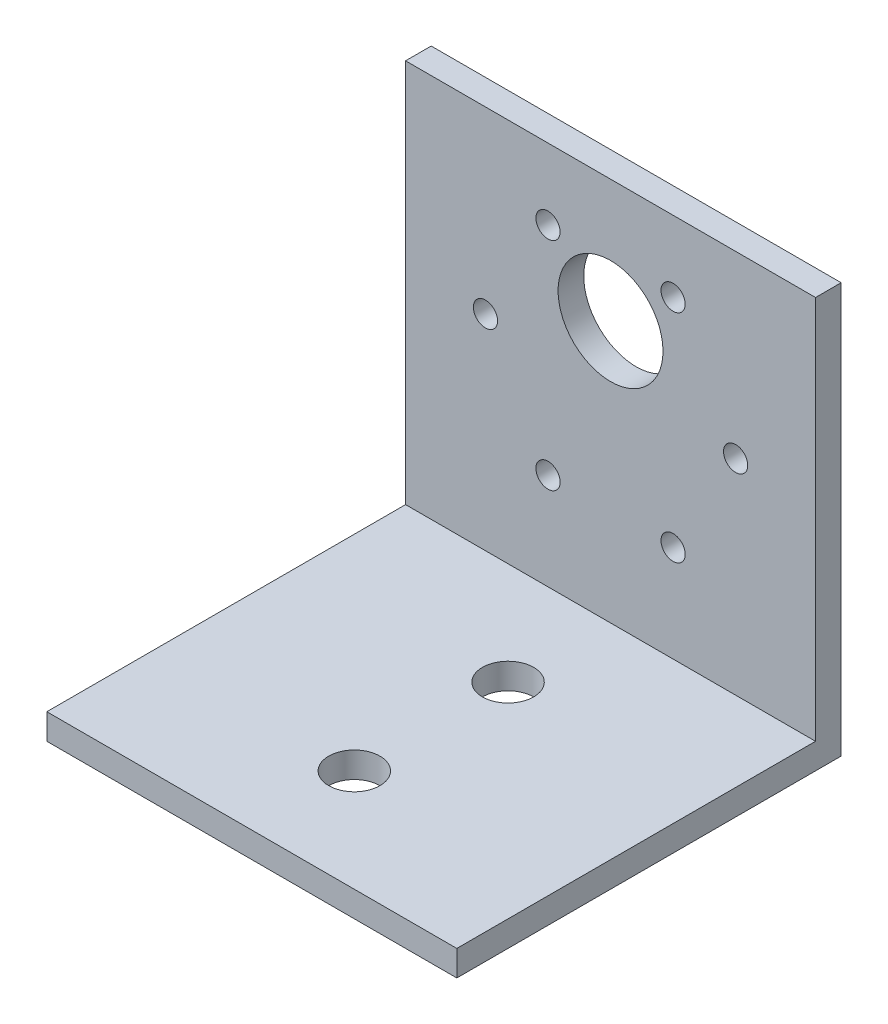
ISO-10303-21;
HEADER;
FILE_DESCRIPTION(('STEP AP214'),'2;1');
FILE_NAME('part.step','',(''),(''),'','','');
FILE_SCHEMA(('AUTOMOTIVE_DESIGN { 1 0 10303 214 1 1 1 1 }'));
ENDSEC;
DATA;
#1=APPLICATION_CONTEXT('core data for automotive mechanical design processes');
#2=APPLICATION_PROTOCOL_DEFINITION('international standard','automotive_design',2000,#1);
#3=PRODUCT_CONTEXT('',#1,'mechanical');
#4=PRODUCT('Part','Part','',(#3));
#5=PRODUCT_RELATED_PRODUCT_CATEGORY('part','',(#4));
#6=PRODUCT_DEFINITION_FORMATION('','',#4);
#7=PRODUCT_DEFINITION_CONTEXT('part definition',#1,'design');
#8=PRODUCT_DEFINITION('design','',#6,#7);
#9=PRODUCT_DEFINITION_SHAPE('','',#8);
#10=(LENGTH_UNIT() NAMED_UNIT(*) SI_UNIT(.MILLI.,.METRE.));
#11=(NAMED_UNIT(*) PLANE_ANGLE_UNIT() SI_UNIT($,.RADIAN.));
#12=(NAMED_UNIT(*) SI_UNIT($,.STERADIAN.) SOLID_ANGLE_UNIT());
#13=UNCERTAINTY_MEASURE_WITH_UNIT(LENGTH_MEASURE(1.E-05),#10,'distance_accuracy_value','');
#14=(GEOMETRIC_REPRESENTATION_CONTEXT(3) GLOBAL_UNCERTAINTY_ASSIGNED_CONTEXT((#13)) GLOBAL_UNIT_ASSIGNED_CONTEXT((#10,
#11,#12)) REPRESENTATION_CONTEXT('',''));
#15=CARTESIAN_POINT('',(0.,0.,0.));
#16=DIRECTION('',(0.,0.,1.));
#17=DIRECTION('',(1.,0.,0.));
#18=AXIS2_PLACEMENT_3D('',#15,#16,#17);
#19=CARTESIAN_POINT('',(0.,0.,3.175));
#20=DIRECTION('',(0.,0.,-1.));
#21=DIRECTION('',(-1.,0.,0.));
#22=AXIS2_PLACEMENT_3D('',#19,#20,#21);
#23=PLANE('',#22);
#24=CARTESIAN_POINT('',(33.15,41.9983937586588,3.175));
#25=DIRECTION('',(0.,0.,1.));
#26=DIRECTION('',(1.,0.,0.));
#27=AXIS2_PLACEMENT_3D('',#24,#25,#26);
#28=CIRCLE('',#27,1.50000000000002);
#29=CARTESIAN_POINT('',(34.65,41.9983937586588,3.175));
#30=VERTEX_POINT('',#29);
#31=EDGE_CURVE('E147',#30,#30,#28,.T.);
#32=ORIENTED_EDGE('',*,*,#31,.F.);
#33=EDGE_LOOP('',(#32));
#34=FACE_BOUND('',#33,.T.);
#35=CARTESIAN_POINT('',(17.65,15.1516062413412,3.175));
#36=DIRECTION('',(0.,0.,1.));
#37=DIRECTION('',(1.,0.,0.));
#38=AXIS2_PLACEMENT_3D('',#35,#36,#37);
#39=CIRCLE('',#38,1.50000000000001);
#40=CARTESIAN_POINT('',(19.15,15.1516062413412,3.175));
#41=VERTEX_POINT('',#40);
#42=EDGE_CURVE('E135',#41,#41,#39,.T.);
#43=ORIENTED_EDGE('',*,*,#42,.F.);
#44=EDGE_LOOP('',(#43));
#45=FACE_BOUND('',#44,.T.);
#46=CARTESIAN_POINT('',(40.9,28.575,3.175));
#47=DIRECTION('',(0.,0.,1.));
#48=DIRECTION('',(1.,0.,0.));
#49=AXIS2_PLACEMENT_3D('',#46,#47,#48);
#50=CIRCLE('',#49,1.5);
#51=CARTESIAN_POINT('',(42.4,28.575,3.175));
#52=VERTEX_POINT('',#51);
#53=EDGE_CURVE('E123',#52,#52,#50,.T.);
#54=ORIENTED_EDGE('',*,*,#53,.F.);
#55=EDGE_LOOP('',(#54));
#56=FACE_BOUND('',#55,.T.);
#57=CARTESIAN_POINT('',(25.4,35.575,3.175));
#58=DIRECTION('',(0.,0.,1.));
#59=DIRECTION('',(1.,0.,0.));
#60=AXIS2_PLACEMENT_3D('',#57,#58,#59);
#61=CIRCLE('',#60,6.50000000000002);
#62=CARTESIAN_POINT('',(31.9,35.575,3.175));
#63=VERTEX_POINT('',#62);
#64=EDGE_CURVE('E97',#63,#63,#61,.T.);
#65=ORIENTED_EDGE('',*,*,#64,.F.);
#66=EDGE_LOOP('',(#65));
#67=FACE_BOUND('',#66,.T.);
#68=CARTESIAN_POINT('',(9.90000000000003,28.575,3.175));
#69=DIRECTION('',(0.,0.,1.));
#70=DIRECTION('',(1.,0.,0.));
#71=AXIS2_PLACEMENT_3D('',#68,#69,#70);
#72=CIRCLE('',#71,1.5);
#73=CARTESIAN_POINT('',(11.4,28.575,3.175));
#74=VERTEX_POINT('',#73);
#75=EDGE_CURVE('E118',#74,#74,#72,.T.);
#76=ORIENTED_EDGE('',*,*,#75,.F.);
#77=EDGE_LOOP('',(#76));
#78=FACE_BOUND('',#77,.T.);
#79=CARTESIAN_POINT('',(33.15,15.1516062413412,3.175));
#80=DIRECTION('',(0.,0.,1.));
#81=DIRECTION('',(1.,0.,0.));
#82=AXIS2_PLACEMENT_3D('',#79,#80,#81);
#83=CIRCLE('',#82,1.5);
#84=CARTESIAN_POINT('',(34.65,15.1516062413412,3.175));
#85=VERTEX_POINT('',#84);
#86=EDGE_CURVE('E129',#85,#85,#83,.T.);
#87=ORIENTED_EDGE('',*,*,#86,.F.);
#88=EDGE_LOOP('',(#87));
#89=FACE_BOUND('',#88,.T.);
#90=CARTESIAN_POINT('',(17.65,41.9983937586588,3.175));
#91=DIRECTION('',(0.,0.,1.));
#92=DIRECTION('',(1.,0.,0.));
#93=AXIS2_PLACEMENT_3D('',#90,#91,#92);
#94=CIRCLE('',#93,1.50000000000001);
#95=CARTESIAN_POINT('',(19.15,41.9983937586588,3.175));
#96=VERTEX_POINT('',#95);
#97=EDGE_CURVE('E141',#96,#96,#94,.T.);
#98=ORIENTED_EDGE('',*,*,#97,.F.);
#99=EDGE_LOOP('',(#98));
#100=FACE_BOUND('',#99,.T.);
#101=DIRECTION('',(-1.,0.,0.));
#102=VECTOR('',#101,1.);
#103=CARTESIAN_POINT('',(0.,3.175,3.175));
#104=LINE('',#103,#102);
#105=CARTESIAN_POINT('',(50.8,3.175,3.175));
#106=VERTEX_POINT('',#105);
#107=CARTESIAN_POINT('',(0.,3.175,3.175));
#108=VERTEX_POINT('',#107);
#109=EDGE_CURVE('E50',#106,#108,#104,.T.);
#110=ORIENTED_EDGE('',*,*,#109,.F.);
#111=DIRECTION('',(0.,1.,0.));
#112=VECTOR('',#111,1.);
#113=CARTESIAN_POINT('',(50.8,0.,3.175));
#114=LINE('',#113,#112);
#115=CARTESIAN_POINT('',(50.8,50.8,3.175));
#116=VERTEX_POINT('',#115);
#117=EDGE_CURVE('E112',#106,#116,#114,.T.);
#118=ORIENTED_EDGE('',*,*,#117,.T.);
#119=DIRECTION('',(-1.,0.,0.));
#120=VECTOR('',#119,1.);
#121=CARTESIAN_POINT('',(0.,50.8,3.175));
#122=LINE('',#121,#120);
#123=CARTESIAN_POINT('',(0.,50.8,3.175));
#124=VERTEX_POINT('',#123);
#125=EDGE_CURVE('E56',#116,#124,#122,.T.);
#126=ORIENTED_EDGE('',*,*,#125,.T.);
#127=DIRECTION('',(0.,-1.,0.));
#128=VECTOR('',#127,1.);
#129=CARTESIAN_POINT('',(0.,0.,3.175));
#130=LINE('',#129,#128);
#131=EDGE_CURVE('E85',#124,#108,#130,.T.);
#132=ORIENTED_EDGE('',*,*,#131,.T.);
#133=EDGE_LOOP('',(#110,#118,#126,#132));
#134=FACE_BOUND('',#133,.T.);
#135=ADVANCED_FACE('F33',(#34,#45,#56,#67,#78,#89,#100,#134),#23,.F.);
#136=CARTESIAN_POINT('',(0.,0.,0.));
#137=DIRECTION('',(0.,0.,-1.));
#138=DIRECTION('',(-1.,0.,0.));
#139=AXIS2_PLACEMENT_3D('',#136,#137,#138);
#140=PLANE('',#139);
#141=CARTESIAN_POINT('',(17.65,41.9983937586588,0.));
#142=DIRECTION('',(0.,0.,1.));
#143=DIRECTION('',(1.,0.,0.));
#144=AXIS2_PLACEMENT_3D('',#141,#142,#143);
#145=CIRCLE('',#144,1.50000000000001);
#146=CARTESIAN_POINT('',(19.15,41.9983937586588,0.));
#147=VERTEX_POINT('',#146);
#148=EDGE_CURVE('E144',#147,#147,#145,.T.);
#149=ORIENTED_EDGE('',*,*,#148,.T.);
#150=EDGE_LOOP('',(#149));
#151=FACE_BOUND('',#150,.T.);
#152=CARTESIAN_POINT('',(33.15,15.1516062413412,0.));
#153=DIRECTION('',(0.,0.,1.));
#154=DIRECTION('',(1.,0.,0.));
#155=AXIS2_PLACEMENT_3D('',#152,#153,#154);
#156=CIRCLE('',#155,1.5);
#157=CARTESIAN_POINT('',(34.65,15.1516062413412,0.));
#158=VERTEX_POINT('',#157);
#159=EDGE_CURVE('E132',#158,#158,#156,.T.);
#160=ORIENTED_EDGE('',*,*,#159,.T.);
#161=EDGE_LOOP('',(#160));
#162=FACE_BOUND('',#161,.T.);
#163=CARTESIAN_POINT('',(9.90000000000003,28.575,0.));
#164=DIRECTION('',(0.,0.,1.));
#165=DIRECTION('',(1.,0.,0.));
#166=AXIS2_PLACEMENT_3D('',#163,#164,#165);
#167=CIRCLE('',#166,1.5);
#168=CARTESIAN_POINT('',(11.4,28.575,0.));
#169=VERTEX_POINT('',#168);
#170=EDGE_CURVE('E120',#169,#169,#167,.T.);
#171=ORIENTED_EDGE('',*,*,#170,.T.);
#172=EDGE_LOOP('',(#171));
#173=FACE_BOUND('',#172,.T.);
#174=DIRECTION('',(0.,-1.,0.));
#175=VECTOR('',#174,1.);
#176=CARTESIAN_POINT('',(0.,0.,0.));
#177=LINE('',#176,#175);
#178=CARTESIAN_POINT('',(0.,50.8,0.));
#179=VERTEX_POINT('',#178);
#180=CARTESIAN_POINT('',(0.,0.,0.));
#181=VERTEX_POINT('',#180);
#182=EDGE_CURVE('E91',#179,#181,#177,.T.);
#183=ORIENTED_EDGE('',*,*,#182,.F.);
#184=DIRECTION('',(-1.,0.,0.));
#185=VECTOR('',#184,1.);
#186=CARTESIAN_POINT('',(0.,50.8,0.));
#187=LINE('',#186,#185);
#188=CARTESIAN_POINT('',(50.8,50.8,0.));
#189=VERTEX_POINT('',#188);
#190=EDGE_CURVE('E75',#189,#179,#187,.T.);
#191=ORIENTED_EDGE('',*,*,#190,.F.);
#192=DIRECTION('',(0.,1.,0.));
#193=VECTOR('',#192,1.);
#194=CARTESIAN_POINT('',(50.8,0.,0.));
#195=LINE('',#194,#193);
#196=CARTESIAN_POINT('',(50.8,0.,0.));
#197=VERTEX_POINT('',#196);
#198=EDGE_CURVE('E86',#197,#189,#195,.T.);
#199=ORIENTED_EDGE('',*,*,#198,.F.);
#200=DIRECTION('',(1.,0.,0.));
#201=VECTOR('',#200,1.);
#202=CARTESIAN_POINT('',(0.,0.,0.));
#203=LINE('',#202,#201);
#204=EDGE_CURVE('E96',#181,#197,#203,.T.);
#205=ORIENTED_EDGE('',*,*,#204,.F.);
#206=EDGE_LOOP('',(#183,#191,#199,#205));
#207=FACE_BOUND('',#206,.T.);
#208=CARTESIAN_POINT('',(25.4,35.575,0.));
#209=DIRECTION('',(0.,0.,1.));
#210=DIRECTION('',(1.,0.,0.));
#211=AXIS2_PLACEMENT_3D('',#208,#209,#210);
#212=CIRCLE('',#211,6.50000000000002);
#213=CARTESIAN_POINT('',(31.9,35.575,0.));
#214=VERTEX_POINT('',#213);
#215=EDGE_CURVE('E101',#214,#214,#212,.T.);
#216=ORIENTED_EDGE('',*,*,#215,.T.);
#217=EDGE_LOOP('',(#216));
#218=FACE_BOUND('',#217,.T.);
#219=CARTESIAN_POINT('',(40.9,28.575,0.));
#220=DIRECTION('',(0.,0.,1.));
#221=DIRECTION('',(1.,0.,0.));
#222=AXIS2_PLACEMENT_3D('',#219,#220,#221);
#223=CIRCLE('',#222,1.5);
#224=CARTESIAN_POINT('',(42.4,28.575,0.));
#225=VERTEX_POINT('',#224);
#226=EDGE_CURVE('E126',#225,#225,#223,.T.);
#227=ORIENTED_EDGE('',*,*,#226,.T.);
#228=EDGE_LOOP('',(#227));
#229=FACE_BOUND('',#228,.T.);
#230=CARTESIAN_POINT('',(17.65,15.1516062413412,0.));
#231=DIRECTION('',(0.,0.,1.));
#232=DIRECTION('',(1.,0.,0.));
#233=AXIS2_PLACEMENT_3D('',#230,#231,#232);
#234=CIRCLE('',#233,1.50000000000001);
#235=CARTESIAN_POINT('',(19.15,15.1516062413412,0.));
#236=VERTEX_POINT('',#235);
#237=EDGE_CURVE('E138',#236,#236,#234,.T.);
#238=ORIENTED_EDGE('',*,*,#237,.T.);
#239=EDGE_LOOP('',(#238));
#240=FACE_BOUND('',#239,.T.);
#241=CARTESIAN_POINT('',(33.15,41.9983937586588,0.));
#242=DIRECTION('',(0.,0.,1.));
#243=DIRECTION('',(1.,0.,0.));
#244=AXIS2_PLACEMENT_3D('',#241,#242,#243);
#245=CIRCLE('',#244,1.50000000000002);
#246=CARTESIAN_POINT('',(34.65,41.9983937586588,0.));
#247=VERTEX_POINT('',#246);
#248=EDGE_CURVE('E150',#247,#247,#245,.T.);
#249=ORIENTED_EDGE('',*,*,#248,.T.);
#250=EDGE_LOOP('',(#249));
#251=FACE_BOUND('',#250,.T.);
#252=ADVANCED_FACE('F94',(#151,#162,#173,#207,#218,#229,#240,#251),#140,.T.);
#253=CARTESIAN_POINT('',(0.,0.,3.175));
#254=DIRECTION('',(1.,0.,0.));
#255=DIRECTION('',(0.,0.,-1.));
#256=AXIS2_PLACEMENT_3D('',#253,#254,#255);
#257=PLANE('',#256);
#258=ORIENTED_EDGE('',*,*,#182,.T.);
#259=DIRECTION('',(0.,0.,-1.));
#260=VECTOR('',#259,1.);
#261=CARTESIAN_POINT('',(0.,0.,3.175));
#262=LINE('',#261,#260);
#263=CARTESIAN_POINT('',(0.,0.,47.625));
#264=VERTEX_POINT('',#263);
#265=EDGE_CURVE('E11',#264,#181,#262,.T.);
#266=ORIENTED_EDGE('',*,*,#265,.F.);
#267=DIRECTION('',(0.,-1.,0.));
#268=VECTOR('',#267,1.);
#269=CARTESIAN_POINT('',(0.,0.,47.625));
#270=LINE('',#269,#268);
#271=CARTESIAN_POINT('',(0.,3.175,47.625));
#272=VERTEX_POINT('',#271);
#273=EDGE_CURVE('E161',#272,#264,#270,.T.);
#274=ORIENTED_EDGE('',*,*,#273,.F.);
#275=DIRECTION('',(0.,0.,-1.));
#276=VECTOR('',#275,1.);
#277=CARTESIAN_POINT('',(0.,3.175,47.625));
#278=LINE('',#277,#276);
#279=EDGE_CURVE('E163',#272,#108,#278,.T.);
#280=ORIENTED_EDGE('',*,*,#279,.T.);
#281=ORIENTED_EDGE('',*,*,#131,.F.);
#282=DIRECTION('',(0.,0.,-1.));
#283=VECTOR('',#282,1.);
#284=CARTESIAN_POINT('',(0.,50.8,3.175));
#285=LINE('',#284,#283);
#286=EDGE_CURVE('E78',#124,#179,#285,.T.);
#287=ORIENTED_EDGE('',*,*,#286,.T.);
#288=EDGE_LOOP('',(#258,#266,#274,#280,#281,#287));
#289=FACE_BOUND('',#288,.T.);
#290=ADVANCED_FACE('F35',(#289),#257,.F.);
#291=CARTESIAN_POINT('',(0.,0.,3.175));
#292=DIRECTION('',(0.,1.,0.));
#293=DIRECTION('',(-1.,0.,0.));
#294=AXIS2_PLACEMENT_3D('',#291,#292,#293);
#295=PLANE('',#294);
#296=CARTESIAN_POINT('',(25.4,0.,34.925));
#297=DIRECTION('',(0.,1.,0.));
#298=DIRECTION('',(0.,0.,1.));
#299=AXIS2_PLACEMENT_3D('',#296,#297,#298);
#300=CIRCLE('',#299,3.175);
#301=CARTESIAN_POINT('',(25.4,0.,38.1));
#302=VERTEX_POINT('',#301);
#303=EDGE_CURVE('E202',#302,#302,#300,.T.);
#304=ORIENTED_EDGE('',*,*,#303,.T.);
#305=EDGE_LOOP('',(#304));
#306=FACE_BOUND('',#305,.T.);
#307=CARTESIAN_POINT('',(25.4,0.,15.875));
#308=DIRECTION('',(0.,1.,0.));
#309=DIRECTION('',(0.,0.,1.));
#310=AXIS2_PLACEMENT_3D('',#307,#308,#309);
#311=CIRCLE('',#310,3.175);
#312=CARTESIAN_POINT('',(25.4,0.,19.05));
#313=VERTEX_POINT('',#312);
#314=EDGE_CURVE('E162',#313,#313,#311,.T.);
#315=ORIENTED_EDGE('',*,*,#314,.T.);
#316=EDGE_LOOP('',(#315));
#317=FACE_BOUND('',#316,.T.);
#318=ORIENTED_EDGE('',*,*,#204,.T.);
#319=DIRECTION('',(0.,0.,-1.));
#320=VECTOR('',#319,1.);
#321=CARTESIAN_POINT('',(50.8,0.,3.175));
#322=LINE('',#321,#320);
#323=CARTESIAN_POINT('',(50.8,0.,47.625));
#324=VERTEX_POINT('',#323);
#325=EDGE_CURVE('E42',#324,#197,#322,.T.);
#326=ORIENTED_EDGE('',*,*,#325,.F.);
#327=DIRECTION('',(1.,0.,0.));
#328=VECTOR('',#327,1.);
#329=CARTESIAN_POINT('',(0.,0.,47.625));
#330=LINE('',#329,#328);
#331=EDGE_CURVE('E193',#264,#324,#330,.T.);
#332=ORIENTED_EDGE('',*,*,#331,.F.);
#333=ORIENTED_EDGE('',*,*,#265,.T.);
#334=EDGE_LOOP('',(#318,#326,#332,#333));
#335=FACE_BOUND('',#334,.T.);
#336=ADVANCED_FACE('F194',(#306,#317,#335),#295,.F.);
#337=CARTESIAN_POINT('',(50.8,0.,3.175));
#338=DIRECTION('',(-1.,0.,0.));
#339=DIRECTION('',(0.,-1.,0.));
#340=AXIS2_PLACEMENT_3D('',#337,#338,#339);
#341=PLANE('',#340);
#342=ORIENTED_EDGE('',*,*,#198,.T.);
#343=DIRECTION('',(0.,0.,-1.));
#344=VECTOR('',#343,1.);
#345=CARTESIAN_POINT('',(50.8,50.8,3.175));
#346=LINE('',#345,#344);
#347=EDGE_CURVE('E81',#116,#189,#346,.T.);
#348=ORIENTED_EDGE('',*,*,#347,.F.);
#349=ORIENTED_EDGE('',*,*,#117,.F.);
#350=DIRECTION('',(0.,0.,-1.));
#351=VECTOR('',#350,1.);
#352=CARTESIAN_POINT('',(50.8,3.175,47.625));
#353=LINE('',#352,#351);
#354=CARTESIAN_POINT('',(50.8,3.175,47.625));
#355=VERTEX_POINT('',#354);
#356=EDGE_CURVE('E153',#355,#106,#353,.T.);
#357=ORIENTED_EDGE('',*,*,#356,.F.);
#358=DIRECTION('',(0.,1.,0.));
#359=VECTOR('',#358,1.);
#360=CARTESIAN_POINT('',(50.8,0.,47.625));
#361=LINE('',#360,#359);
#362=EDGE_CURVE('E180',#324,#355,#361,.T.);
#363=ORIENTED_EDGE('',*,*,#362,.F.);
#364=ORIENTED_EDGE('',*,*,#325,.T.);
#365=EDGE_LOOP('',(#342,#348,#349,#357,#363,#364));
#366=FACE_BOUND('',#365,.T.);
#367=ADVANCED_FACE('F177',(#366),#341,.F.);
#368=CARTESIAN_POINT('',(0.,50.8,3.175));
#369=DIRECTION('',(0.,-1.,0.));
#370=DIRECTION('',(1.,0.,0.));
#371=AXIS2_PLACEMENT_3D('',#368,#369,#370);
#372=PLANE('',#371);
#373=ORIENTED_EDGE('',*,*,#190,.T.);
#374=ORIENTED_EDGE('',*,*,#286,.F.);
#375=ORIENTED_EDGE('',*,*,#125,.F.);
#376=ORIENTED_EDGE('',*,*,#347,.T.);
#377=EDGE_LOOP('',(#373,#374,#375,#376));
#378=FACE_BOUND('',#377,.T.);
#379=ADVANCED_FACE('F77',(#378),#372,.F.);
#380=CARTESIAN_POINT('',(25.4,35.575,3.175));
#381=DIRECTION('',(0.,0.,-1.));
#382=DIRECTION('',(-1.,0.,0.));
#383=AXIS2_PLACEMENT_3D('',#380,#381,#382);
#384=CYLINDRICAL_SURFACE('',#383,6.50000000000002);
#385=ORIENTED_EDGE('',*,*,#64,.T.);
#386=EDGE_LOOP('',(#385));
#387=FACE_BOUND('',#386,.T.);
#388=ORIENTED_EDGE('',*,*,#215,.F.);
#389=EDGE_LOOP('',(#388));
#390=FACE_BOUND('',#389,.T.);
#391=ADVANCED_FACE('F245',(#387,#390),#384,.F.);
#392=CARTESIAN_POINT('',(9.90000000000003,28.575,3.175));
#393=DIRECTION('',(0.,0.,-1.));
#394=DIRECTION('',(-1.,0.,0.));
#395=AXIS2_PLACEMENT_3D('',#392,#393,#394);
#396=CYLINDRICAL_SURFACE('',#395,1.5);
#397=ORIENTED_EDGE('',*,*,#75,.T.);
#398=EDGE_LOOP('',(#397));
#399=FACE_BOUND('',#398,.T.);
#400=ORIENTED_EDGE('',*,*,#170,.F.);
#401=EDGE_LOOP('',(#400));
#402=FACE_BOUND('',#401,.T.);
#403=ADVANCED_FACE('F279',(#399,#402),#396,.F.);
#404=CARTESIAN_POINT('',(40.9,28.575,3.175));
#405=DIRECTION('',(0.,0.,-1.));
#406=DIRECTION('',(-1.,0.,0.));
#407=AXIS2_PLACEMENT_3D('',#404,#405,#406);
#408=CYLINDRICAL_SURFACE('',#407,1.5);
#409=ORIENTED_EDGE('',*,*,#53,.T.);
#410=EDGE_LOOP('',(#409));
#411=FACE_BOUND('',#410,.T.);
#412=ORIENTED_EDGE('',*,*,#226,.F.);
#413=EDGE_LOOP('',(#412));
#414=FACE_BOUND('',#413,.T.);
#415=ADVANCED_FACE('F288',(#411,#414),#408,.F.);
#416=CARTESIAN_POINT('',(33.15,15.1516062413412,3.175));
#417=DIRECTION('',(0.,0.,-1.));
#418=DIRECTION('',(-1.,0.,0.));
#419=AXIS2_PLACEMENT_3D('',#416,#417,#418);
#420=CYLINDRICAL_SURFACE('',#419,1.5);
#421=ORIENTED_EDGE('',*,*,#86,.T.);
#422=EDGE_LOOP('',(#421));
#423=FACE_BOUND('',#422,.T.);
#424=ORIENTED_EDGE('',*,*,#159,.F.);
#425=EDGE_LOOP('',(#424));
#426=FACE_BOUND('',#425,.T.);
#427=ADVANCED_FACE('F297',(#423,#426),#420,.F.);
#428=CARTESIAN_POINT('',(17.65,15.1516062413412,3.175));
#429=DIRECTION('',(0.,0.,-1.));
#430=DIRECTION('',(-1.,0.,0.));
#431=AXIS2_PLACEMENT_3D('',#428,#429,#430);
#432=CYLINDRICAL_SURFACE('',#431,1.50000000000001);
#433=ORIENTED_EDGE('',*,*,#42,.T.);
#434=EDGE_LOOP('',(#433));
#435=FACE_BOUND('',#434,.T.);
#436=ORIENTED_EDGE('',*,*,#237,.F.);
#437=EDGE_LOOP('',(#436));
#438=FACE_BOUND('',#437,.T.);
#439=ADVANCED_FACE('F307',(#435,#438),#432,.F.);
#440=CARTESIAN_POINT('',(17.65,41.9983937586588,3.175));
#441=DIRECTION('',(0.,0.,-1.));
#442=DIRECTION('',(-1.,0.,0.));
#443=AXIS2_PLACEMENT_3D('',#440,#441,#442);
#444=CYLINDRICAL_SURFACE('',#443,1.50000000000001);
#445=ORIENTED_EDGE('',*,*,#97,.T.);
#446=EDGE_LOOP('',(#445));
#447=FACE_BOUND('',#446,.T.);
#448=ORIENTED_EDGE('',*,*,#148,.F.);
#449=EDGE_LOOP('',(#448));
#450=FACE_BOUND('',#449,.T.);
#451=ADVANCED_FACE('F317',(#447,#450),#444,.F.);
#452=CARTESIAN_POINT('',(33.15,41.9983937586588,3.175));
#453=DIRECTION('',(0.,0.,-1.));
#454=DIRECTION('',(-1.,0.,0.));
#455=AXIS2_PLACEMENT_3D('',#452,#453,#454);
#456=CYLINDRICAL_SURFACE('',#455,1.50000000000002);
#457=ORIENTED_EDGE('',*,*,#31,.T.);
#458=EDGE_LOOP('',(#457));
#459=FACE_BOUND('',#458,.T.);
#460=ORIENTED_EDGE('',*,*,#248,.F.);
#461=EDGE_LOOP('',(#460));
#462=FACE_BOUND('',#461,.T.);
#463=ADVANCED_FACE('F222',(#459,#462),#456,.F.);
#464=CARTESIAN_POINT('',(0.,3.175,47.625));
#465=DIRECTION('',(0.,-1.,0.));
#466=DIRECTION('',(0.,0.,-1.));
#467=AXIS2_PLACEMENT_3D('',#464,#465,#466);
#468=PLANE('',#467);
#469=CARTESIAN_POINT('',(25.4,3.175,34.925));
#470=DIRECTION('',(0.,1.,0.));
#471=DIRECTION('',(0.,0.,1.));
#472=AXIS2_PLACEMENT_3D('',#469,#470,#471);
#473=CIRCLE('',#472,3.175);
#474=CARTESIAN_POINT('',(25.4,3.175,38.1));
#475=VERTEX_POINT('',#474);
#476=EDGE_CURVE('E205',#475,#475,#473,.T.);
#477=ORIENTED_EDGE('',*,*,#476,.F.);
#478=EDGE_LOOP('',(#477));
#479=FACE_BOUND('',#478,.T.);
#480=CARTESIAN_POINT('',(25.4,3.175,15.875));
#481=DIRECTION('',(0.,1.,0.));
#482=DIRECTION('',(0.,0.,1.));
#483=AXIS2_PLACEMENT_3D('',#480,#481,#482);
#484=CIRCLE('',#483,3.175);
#485=CARTESIAN_POINT('',(25.4,3.175,19.05));
#486=VERTEX_POINT('',#485);
#487=EDGE_CURVE('E199',#486,#486,#484,.T.);
#488=ORIENTED_EDGE('',*,*,#487,.F.);
#489=EDGE_LOOP('',(#488));
#490=FACE_BOUND('',#489,.T.);
#491=ORIENTED_EDGE('',*,*,#109,.T.);
#492=ORIENTED_EDGE('',*,*,#279,.F.);
#493=DIRECTION('',(-1.,0.,0.));
#494=VECTOR('',#493,1.);
#495=CARTESIAN_POINT('',(0.,3.175,47.625));
#496=LINE('',#495,#494);
#497=EDGE_CURVE('E158',#355,#272,#496,.T.);
#498=ORIENTED_EDGE('',*,*,#497,.F.);
#499=ORIENTED_EDGE('',*,*,#356,.T.);
#500=EDGE_LOOP('',(#491,#492,#498,#499));
#501=FACE_BOUND('',#500,.T.);
#502=ADVANCED_FACE('F170',(#479,#490,#501),#468,.F.);
#503=CARTESIAN_POINT('',(0.,0.,47.625));
#504=DIRECTION('',(0.,0.,-1.));
#505=DIRECTION('',(-1.,0.,0.));
#506=AXIS2_PLACEMENT_3D('',#503,#504,#505);
#507=PLANE('',#506);
#508=ORIENTED_EDGE('',*,*,#273,.T.);
#509=ORIENTED_EDGE('',*,*,#331,.T.);
#510=ORIENTED_EDGE('',*,*,#362,.T.);
#511=ORIENTED_EDGE('',*,*,#497,.T.);
#512=EDGE_LOOP('',(#508,#509,#510,#511));
#513=FACE_BOUND('',#512,.T.);
#514=ADVANCED_FACE('F196',(#513),#507,.F.);
#515=CARTESIAN_POINT('',(25.4,0.,15.875));
#516=DIRECTION('',(0.,1.,0.));
#517=DIRECTION('',(0.,0.,1.));
#518=AXIS2_PLACEMENT_3D('',#515,#516,#517);
#519=CYLINDRICAL_SURFACE('',#518,3.175);
#520=ORIENTED_EDGE('',*,*,#314,.F.);
#521=EDGE_LOOP('',(#520));
#522=FACE_BOUND('',#521,.T.);
#523=ORIENTED_EDGE('',*,*,#487,.T.);
#524=EDGE_LOOP('',(#523));
#525=FACE_BOUND('',#524,.T.);
#526=ADVANCED_FACE('F216',(#522,#525),#519,.F.);
#527=CARTESIAN_POINT('',(25.4,0.,34.925));
#528=DIRECTION('',(0.,1.,0.));
#529=DIRECTION('',(0.,0.,1.));
#530=AXIS2_PLACEMENT_3D('',#527,#528,#529);
#531=CYLINDRICAL_SURFACE('',#530,3.175);
#532=ORIENTED_EDGE('',*,*,#303,.F.);
#533=EDGE_LOOP('',(#532));
#534=FACE_BOUND('',#533,.T.);
#535=ORIENTED_EDGE('',*,*,#476,.T.);
#536=EDGE_LOOP('',(#535));
#537=FACE_BOUND('',#536,.T.);
#538=ADVANCED_FACE('F213',(#534,#537),#531,.F.);
#539=CLOSED_SHELL('',(#135,#252,#290,#336,#367,#379,#391,#403,#415,#427,#439,#451,#463,#502,
#514,#526,#538));
#540=MANIFOLD_SOLID_BREP('B2',#539);
#541=ADVANCED_BREP_SHAPE_REPRESENTATION('',(#18,#540),#14);
#542=SHAPE_DEFINITION_REPRESENTATION(#9,#541);
ENDSEC;
END-ISO-10303-21;
